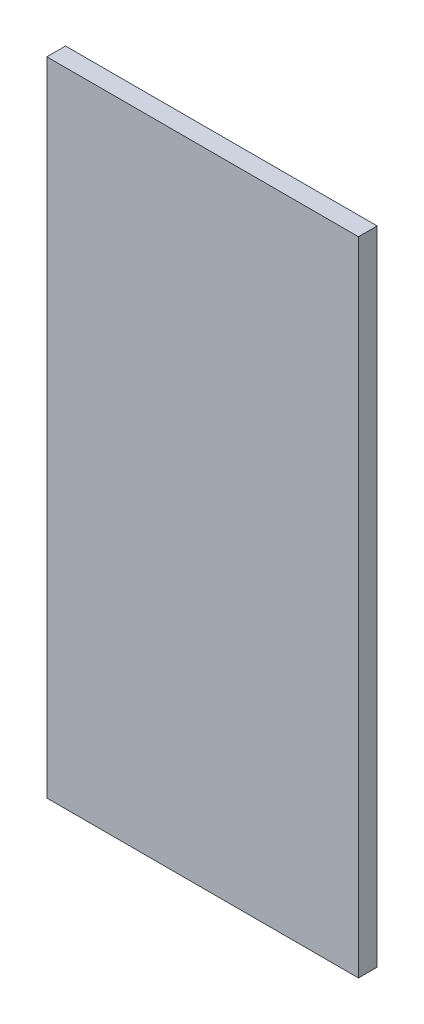
ISO-10303-21;
HEADER;
FILE_DESCRIPTION(('STEP AP214'),'2;1');
FILE_NAME('part.step','',(''),(''),'','','');
FILE_SCHEMA(('AUTOMOTIVE_DESIGN { 1 0 10303 214 1 1 1 1 }'));
ENDSEC;
DATA;
#1=APPLICATION_CONTEXT('core data for automotive mechanical design processes');
#2=APPLICATION_PROTOCOL_DEFINITION('international standard','automotive_design',2000,#1);
#3=PRODUCT_CONTEXT('',#1,'mechanical');
#4=PRODUCT('Part','Part','',(#3));
#5=PRODUCT_RELATED_PRODUCT_CATEGORY('part','',(#4));
#6=PRODUCT_DEFINITION_FORMATION('','',#4);
#7=PRODUCT_DEFINITION_CONTEXT('part definition',#1,'design');
#8=PRODUCT_DEFINITION('design','',#6,#7);
#9=PRODUCT_DEFINITION_SHAPE('','',#8);
#10=(LENGTH_UNIT() NAMED_UNIT(*) SI_UNIT(.MILLI.,.METRE.));
#11=(NAMED_UNIT(*) PLANE_ANGLE_UNIT() SI_UNIT($,.RADIAN.));
#12=(NAMED_UNIT(*) SI_UNIT($,.STERADIAN.) SOLID_ANGLE_UNIT());
#13=UNCERTAINTY_MEASURE_WITH_UNIT(LENGTH_MEASURE(1.E-05),#10,'distance_accuracy_value','');
#14=(GEOMETRIC_REPRESENTATION_CONTEXT(3) GLOBAL_UNCERTAINTY_ASSIGNED_CONTEXT((#13)) GLOBAL_UNIT_ASSIGNED_CONTEXT((#10,
#11,#12)) REPRESENTATION_CONTEXT('',''));
#15=CARTESIAN_POINT('',(0.,0.,0.));
#16=DIRECTION('',(0.,0.,1.));
#17=DIRECTION('',(1.,0.,0.));
#18=AXIS2_PLACEMENT_3D('',#15,#16,#17);
#19=CARTESIAN_POINT('',(-10.,199.427419354839,6.));
#20=DIRECTION('',(1.,0.,0.));
#21=DIRECTION('',(0.,1.,0.));
#22=AXIS2_PLACEMENT_3D('',#19,#20,#21);
#23=PLANE('',#22);
#24=DIRECTION('',(0.,-1.,0.));
#25=VECTOR('',#24,1.);
#26=CARTESIAN_POINT('',(-10.,199.427419354839,0.));
#27=LINE('',#26,#25);
#28=CARTESIAN_POINT('',(-10.,199.427419354839,0.));
#29=VERTEX_POINT('',#28);
#30=CARTESIAN_POINT('',(-10.,-6.57258064516129,0.));
#31=VERTEX_POINT('',#30);
#32=EDGE_CURVE('E107',#29,#31,#27,.T.);
#33=ORIENTED_EDGE('',*,*,#32,.T.);
#34=DIRECTION('',(0.,0.,-1.));
#35=VECTOR('',#34,1.);
#36=CARTESIAN_POINT('',(-10.,-6.57258064516129,6.));
#37=LINE('',#36,#35);
#38=CARTESIAN_POINT('',(-10.,-6.57258064516129,6.));
#39=VERTEX_POINT('',#38);
#40=EDGE_CURVE('E11',#39,#31,#37,.T.);
#41=ORIENTED_EDGE('',*,*,#40,.F.);
#42=DIRECTION('',(0.,-1.,0.));
#43=VECTOR('',#42,1.);
#44=CARTESIAN_POINT('',(-10.,199.427419354839,6.));
#45=LINE('',#44,#43);
#46=CARTESIAN_POINT('',(-10.,199.427419354839,6.));
#47=VERTEX_POINT('',#46);
#48=EDGE_CURVE('E91',#47,#39,#45,.T.);
#49=ORIENTED_EDGE('',*,*,#48,.F.);
#50=DIRECTION('',(0.,0.,-1.));
#51=VECTOR('',#50,1.);
#52=CARTESIAN_POINT('',(-10.,199.427419354839,6.));
#53=LINE('',#52,#51);
#54=EDGE_CURVE('E103',#47,#29,#53,.T.);
#55=ORIENTED_EDGE('',*,*,#54,.T.);
#56=EDGE_LOOP('',(#33,#41,#49,#55));
#57=FACE_BOUND('',#56,.T.);
#58=ADVANCED_FACE('F39',(#57),#23,.F.);
#59=CARTESIAN_POINT('',(-10.,-6.57258064516129,6.));
#60=DIRECTION('',(0.,1.,0.));
#61=DIRECTION('',(0.,0.,1.));
#62=AXIS2_PLACEMENT_3D('',#59,#60,#61);
#63=PLANE('',#62);
#64=DIRECTION('',(1.,0.,0.));
#65=VECTOR('',#64,1.);
#66=CARTESIAN_POINT('',(-10.,-6.57258064516129,0.));
#67=LINE('',#66,#65);
#68=CARTESIAN_POINT('',(90.,-6.57258064516129,0.));
#69=VERTEX_POINT('',#68);
#70=EDGE_CURVE('E96',#31,#69,#67,.T.);
#71=ORIENTED_EDGE('',*,*,#70,.T.);
#72=DIRECTION('',(0.,0.,-1.));
#73=VECTOR('',#72,1.);
#74=CARTESIAN_POINT('',(90.,-6.57258064516129,6.));
#75=LINE('',#74,#73);
#76=CARTESIAN_POINT('',(90.,-6.57258064516129,6.));
#77=VERTEX_POINT('',#76);
#78=EDGE_CURVE('E48',#77,#69,#75,.T.);
#79=ORIENTED_EDGE('',*,*,#78,.F.);
#80=DIRECTION('',(1.,0.,0.));
#81=VECTOR('',#80,1.);
#82=CARTESIAN_POINT('',(-10.,-6.57258064516129,6.));
#83=LINE('',#82,#81);
#84=EDGE_CURVE('E86',#39,#77,#83,.T.);
#85=ORIENTED_EDGE('',*,*,#84,.F.);
#86=ORIENTED_EDGE('',*,*,#40,.T.);
#87=EDGE_LOOP('',(#71,#79,#85,#86));
#88=FACE_BOUND('',#87,.T.);
#89=ADVANCED_FACE('F95',(#88),#63,.F.);
#90=CARTESIAN_POINT('',(90.,199.427419354839,6.));
#91=DIRECTION('',(-1.,0.,0.));
#92=DIRECTION('',(0.,-1.,0.));
#93=AXIS2_PLACEMENT_3D('',#90,#91,#92);
#94=PLANE('',#93);
#95=DIRECTION('',(0.,1.,0.));
#96=VECTOR('',#95,1.);
#97=CARTESIAN_POINT('',(90.,199.427419354839,0.));
#98=LINE('',#97,#96);
#99=CARTESIAN_POINT('',(90.,199.427419354839,0.));
#100=VERTEX_POINT('',#99);
#101=EDGE_CURVE('E73',#69,#100,#98,.T.);
#102=ORIENTED_EDGE('',*,*,#101,.T.);
#103=DIRECTION('',(0.,0.,-1.));
#104=VECTOR('',#103,1.);
#105=CARTESIAN_POINT('',(90.,199.427419354839,6.));
#106=LINE('',#105,#104);
#107=CARTESIAN_POINT('',(90.,199.427419354839,6.));
#108=VERTEX_POINT('',#107);
#109=EDGE_CURVE('E98',#108,#100,#106,.T.);
#110=ORIENTED_EDGE('',*,*,#109,.F.);
#111=DIRECTION('',(0.,1.,0.));
#112=VECTOR('',#111,1.);
#113=CARTESIAN_POINT('',(90.,199.427419354839,6.));
#114=LINE('',#113,#112);
#115=EDGE_CURVE('E89',#77,#108,#114,.T.);
#116=ORIENTED_EDGE('',*,*,#115,.F.);
#117=ORIENTED_EDGE('',*,*,#78,.T.);
#118=EDGE_LOOP('',(#102,#110,#116,#117));
#119=FACE_BOUND('',#118,.T.);
#120=ADVANCED_FACE('F99',(#119),#94,.F.);
#121=CARTESIAN_POINT('',(-10.,199.427419354839,6.));
#122=DIRECTION('',(0.,-1.,0.));
#123=DIRECTION('',(0.,0.,-1.));
#124=AXIS2_PLACEMENT_3D('',#121,#122,#123);
#125=PLANE('',#124);
#126=DIRECTION('',(-1.,0.,0.));
#127=VECTOR('',#126,1.);
#128=CARTESIAN_POINT('',(-10.,199.427419354839,0.));
#129=LINE('',#128,#127);
#130=EDGE_CURVE('E79',#100,#29,#129,.T.);
#131=ORIENTED_EDGE('',*,*,#130,.T.);
#132=ORIENTED_EDGE('',*,*,#54,.F.);
#133=DIRECTION('',(-1.,0.,0.));
#134=VECTOR('',#133,1.);
#135=CARTESIAN_POINT('',(-10.,199.427419354839,6.));
#136=LINE('',#135,#134);
#137=EDGE_CURVE('E56',#108,#47,#136,.T.);
#138=ORIENTED_EDGE('',*,*,#137,.F.);
#139=ORIENTED_EDGE('',*,*,#109,.T.);
#140=EDGE_LOOP('',(#131,#132,#138,#139));
#141=FACE_BOUND('',#140,.T.);
#142=ADVANCED_FACE('F120',(#141),#125,.F.);
#143=CARTESIAN_POINT('',(0.,0.,6.));
#144=DIRECTION('',(0.,0.,1.));
#145=DIRECTION('',(1.,0.,0.));
#146=AXIS2_PLACEMENT_3D('',#143,#144,#145);
#147=PLANE('',#146);
#148=ORIENTED_EDGE('',*,*,#48,.T.);
#149=ORIENTED_EDGE('',*,*,#84,.T.);
#150=ORIENTED_EDGE('',*,*,#115,.T.);
#151=ORIENTED_EDGE('',*,*,#137,.T.);
#152=EDGE_LOOP('',(#148,#149,#150,#151));
#153=FACE_BOUND('',#152,.T.);
#154=ADVANCED_FACE('F87',(#153),#147,.T.);
#155=CARTESIAN_POINT('',(0.,0.,0.));
#156=DIRECTION('',(0.,0.,1.));
#157=DIRECTION('',(1.,0.,0.));
#158=AXIS2_PLACEMENT_3D('',#155,#156,#157);
#159=PLANE('',#158);
#160=ORIENTED_EDGE('',*,*,#32,.F.);
#161=ORIENTED_EDGE('',*,*,#130,.F.);
#162=ORIENTED_EDGE('',*,*,#101,.F.);
#163=ORIENTED_EDGE('',*,*,#70,.F.);
#164=EDGE_LOOP('',(#160,#161,#162,#163));
#165=FACE_BOUND('',#164,.T.);
#166=ADVANCED_FACE('F123',(#165),#159,.F.);
#167=CLOSED_SHELL('',(#58,#89,#120,#142,#154,#166));
#168=MANIFOLD_SOLID_BREP('B2',#167);
#169=ADVANCED_BREP_SHAPE_REPRESENTATION('',(#18,#168),#14);
#170=SHAPE_DEFINITION_REPRESENTATION(#9,#169);
ENDSEC;
END-ISO-10303-21;
